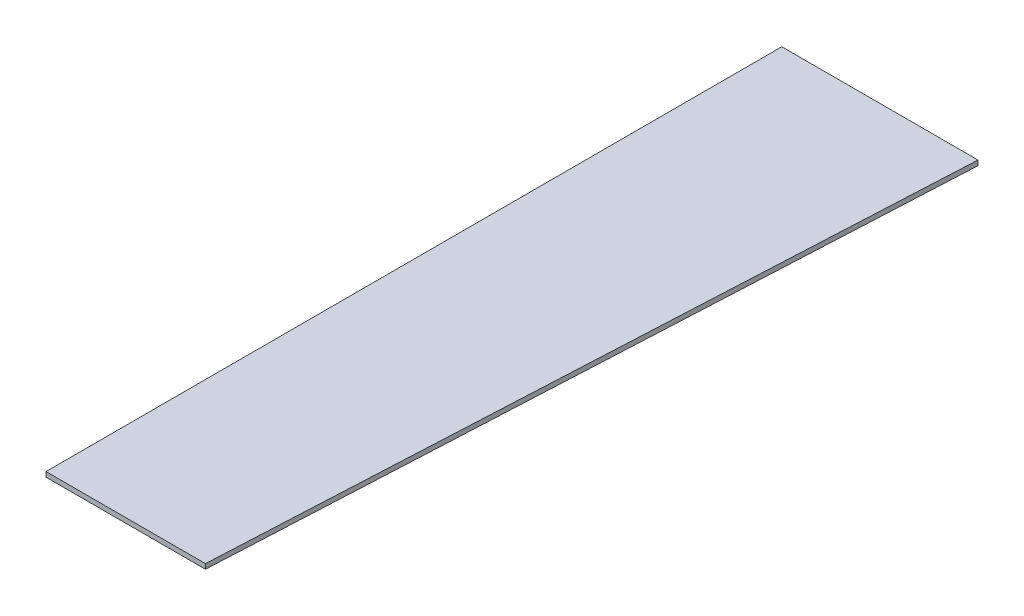
ISO-10303-21;
HEADER;
FILE_DESCRIPTION(('STEP AP214'),'2;1');
FILE_NAME('part.step','',(''),(''),'','','');
FILE_SCHEMA(('AUTOMOTIVE_DESIGN { 1 0 10303 214 1 1 1 1 }'));
ENDSEC;
DATA;
#1=APPLICATION_CONTEXT('core data for automotive mechanical design processes');
#2=APPLICATION_PROTOCOL_DEFINITION('international standard','automotive_design',2000,#1);
#3=PRODUCT_CONTEXT('',#1,'mechanical');
#4=PRODUCT('Part','Part','',(#3));
#5=PRODUCT_RELATED_PRODUCT_CATEGORY('part','',(#4));
#6=PRODUCT_DEFINITION_FORMATION('','',#4);
#7=PRODUCT_DEFINITION_CONTEXT('part definition',#1,'design');
#8=PRODUCT_DEFINITION('design','',#6,#7);
#9=PRODUCT_DEFINITION_SHAPE('','',#8);
#10=(LENGTH_UNIT() NAMED_UNIT(*) SI_UNIT(.MILLI.,.METRE.));
#11=(NAMED_UNIT(*) PLANE_ANGLE_UNIT() SI_UNIT($,.RADIAN.));
#12=(NAMED_UNIT(*) SI_UNIT($,.STERADIAN.) SOLID_ANGLE_UNIT());
#13=UNCERTAINTY_MEASURE_WITH_UNIT(LENGTH_MEASURE(1.E-05),#10,'distance_accuracy_value','');
#14=(GEOMETRIC_REPRESENTATION_CONTEXT(3) GLOBAL_UNCERTAINTY_ASSIGNED_CONTEXT((#13)) GLOBAL_UNIT_ASSIGNED_CONTEXT((#10,
#11,#12)) REPRESENTATION_CONTEXT('',''));
#15=CARTESIAN_POINT('',(0.,0.,0.));
#16=DIRECTION('',(0.,0.,1.));
#17=DIRECTION('',(1.,0.,0.));
#18=AXIS2_PLACEMENT_3D('',#15,#16,#17);
#19=CARTESIAN_POINT('',(0.,10.,0.));
#20=DIRECTION('',(1.,0.,0.));
#21=DIRECTION('',(0.,0.,-1.));
#22=AXIS2_PLACEMENT_3D('',#19,#20,#21);
#23=PLANE('',#22);
#24=DIRECTION('',(0.,0.,1.));
#25=VECTOR('',#24,1.);
#26=CARTESIAN_POINT('',(0.,0.,0.));
#27=LINE('',#26,#25);
#28=CARTESIAN_POINT('',(0.,0.,0.));
#29=VERTEX_POINT('',#28);
#30=CARTESIAN_POINT('',(1.83697019872103E-13,0.,1500.));
#31=VERTEX_POINT('',#30);
#32=EDGE_CURVE('E94',#29,#31,#27,.T.);
#33=ORIENTED_EDGE('',*,*,#32,.T.);
#34=DIRECTION('',(0.,-1.,0.));
#35=VECTOR('',#34,1.);
#36=CARTESIAN_POINT('',(1.83697019872103E-13,10.,1500.));
#37=LINE('',#36,#35);
#38=CARTESIAN_POINT('',(1.83697019872103E-13,10.,1500.));
#39=VERTEX_POINT('',#38);
#40=EDGE_CURVE('E11',#39,#31,#37,.T.);
#41=ORIENTED_EDGE('',*,*,#40,.F.);
#42=DIRECTION('',(0.,0.,1.));
#43=VECTOR('',#42,1.);
#44=CARTESIAN_POINT('',(0.,10.,0.));
#45=LINE('',#44,#43);
#46=CARTESIAN_POINT('',(0.,10.,0.));
#47=VERTEX_POINT('',#46);
#48=EDGE_CURVE('E82',#47,#39,#45,.T.);
#49=ORIENTED_EDGE('',*,*,#48,.F.);
#50=DIRECTION('',(0.,-1.,0.));
#51=VECTOR('',#50,1.);
#52=CARTESIAN_POINT('',(0.,10.,0.));
#53=LINE('',#52,#51);
#54=EDGE_CURVE('E90',#47,#29,#53,.T.);
#55=ORIENTED_EDGE('',*,*,#54,.T.);
#56=EDGE_LOOP('',(#33,#41,#49,#55));
#57=FACE_BOUND('',#56,.T.);
#58=ADVANCED_FACE('F31',(#57),#23,.F.);
#59=CARTESIAN_POINT('',(1.83697019872103E-13,10.,1500.));
#60=DIRECTION('',(0.,0.,-1.));
#61=DIRECTION('',(-1.,0.,0.));
#62=AXIS2_PLACEMENT_3D('',#59,#60,#61);
#63=PLANE('',#62);
#64=DIRECTION('',(1.,0.,0.));
#65=VECTOR('',#64,1.);
#66=CARTESIAN_POINT('',(1.83697019872103E-13,0.,1500.));
#67=LINE('',#66,#65);
#68=CARTESIAN_POINT('',(325.,0.,1500.));
#69=VERTEX_POINT('',#68);
#70=EDGE_CURVE('E86',#31,#69,#67,.T.);
#71=ORIENTED_EDGE('',*,*,#70,.T.);
#72=DIRECTION('',(0.,-1.,0.));
#73=VECTOR('',#72,1.);
#74=CARTESIAN_POINT('',(325.,10.,1500.));
#75=LINE('',#74,#73);
#76=CARTESIAN_POINT('',(325.,10.,1500.));
#77=VERTEX_POINT('',#76);
#78=EDGE_CURVE('E39',#77,#69,#75,.T.);
#79=ORIENTED_EDGE('',*,*,#78,.F.);
#80=DIRECTION('',(1.,0.,0.));
#81=VECTOR('',#80,1.);
#82=CARTESIAN_POINT('',(1.83697019872103E-13,10.,1500.));
#83=LINE('',#82,#81);
#84=EDGE_CURVE('E77',#39,#77,#83,.T.);
#85=ORIENTED_EDGE('',*,*,#84,.F.);
#86=ORIENTED_EDGE('',*,*,#40,.T.);
#87=EDGE_LOOP('',(#71,#79,#85,#86));
#88=FACE_BOUND('',#87,.T.);
#89=ADVANCED_FACE('F85',(#88),#63,.F.);
#90=CARTESIAN_POINT('',(325.,10.,1500.));
#91=DIRECTION('',(-0.998752338877845,0.,-0.0499376169438921));
#92=DIRECTION('',(-0.0499376169438921,0.,0.998752338877845));
#93=AXIS2_PLACEMENT_3D('',#90,#91,#92);
#94=PLANE('',#93);
#95=DIRECTION('',(0.0499376169438921,0.,-0.998752338877845));
#96=VECTOR('',#95,1.);
#97=CARTESIAN_POINT('',(325.,0.,1500.));
#98=LINE('',#97,#96);
#99=CARTESIAN_POINT('',(400.,0.,0.));
#100=VERTEX_POINT('',#99);
#101=EDGE_CURVE('E64',#69,#100,#98,.T.);
#102=ORIENTED_EDGE('',*,*,#101,.T.);
#103=DIRECTION('',(0.,-1.,0.));
#104=VECTOR('',#103,1.);
#105=CARTESIAN_POINT('',(400.,10.,0.));
#106=LINE('',#105,#104);
#107=CARTESIAN_POINT('',(400.,10.,0.));
#108=VERTEX_POINT('',#107);
#109=EDGE_CURVE('E87',#108,#100,#106,.T.);
#110=ORIENTED_EDGE('',*,*,#109,.F.);
#111=DIRECTION('',(0.0499376169438921,0.,-0.998752338877845));
#112=VECTOR('',#111,1.);
#113=CARTESIAN_POINT('',(325.,10.,1500.));
#114=LINE('',#113,#112);
#115=EDGE_CURVE('E80',#77,#108,#114,.T.);
#116=ORIENTED_EDGE('',*,*,#115,.F.);
#117=ORIENTED_EDGE('',*,*,#78,.T.);
#118=EDGE_LOOP('',(#102,#110,#116,#117));
#119=FACE_BOUND('',#118,.T.);
#120=ADVANCED_FACE('F88',(#119),#94,.F.);
#121=CARTESIAN_POINT('',(0.,10.,0.));
#122=DIRECTION('',(0.,0.,1.));
#123=DIRECTION('',(1.,0.,0.));
#124=AXIS2_PLACEMENT_3D('',#121,#122,#123);
#125=PLANE('',#124);
#126=DIRECTION('',(-1.,0.,0.));
#127=VECTOR('',#126,1.);
#128=CARTESIAN_POINT('',(0.,0.,0.));
#129=LINE('',#128,#127);
#130=EDGE_CURVE('E70',#100,#29,#129,.T.);
#131=ORIENTED_EDGE('',*,*,#130,.T.);
#132=ORIENTED_EDGE('',*,*,#54,.F.);
#133=DIRECTION('',(-1.,0.,0.));
#134=VECTOR('',#133,1.);
#135=CARTESIAN_POINT('',(0.,10.,0.));
#136=LINE('',#135,#134);
#137=EDGE_CURVE('E47',#108,#47,#136,.T.);
#138=ORIENTED_EDGE('',*,*,#137,.F.);
#139=ORIENTED_EDGE('',*,*,#109,.T.);
#140=EDGE_LOOP('',(#131,#132,#138,#139));
#141=FACE_BOUND('',#140,.T.);
#142=ADVANCED_FACE('F101',(#141),#125,.F.);
#143=CARTESIAN_POINT('',(1.83697019872103E-13,10.,1500.));
#144=DIRECTION('',(0.,1.,0.));
#145=DIRECTION('',(0.,0.,1.));
#146=AXIS2_PLACEMENT_3D('',#143,#144,#145);
#147=PLANE('',#146);
#148=ORIENTED_EDGE('',*,*,#48,.T.);
#149=ORIENTED_EDGE('',*,*,#84,.T.);
#150=ORIENTED_EDGE('',*,*,#115,.T.);
#151=ORIENTED_EDGE('',*,*,#137,.T.);
#152=EDGE_LOOP('',(#148,#149,#150,#151));
#153=FACE_BOUND('',#152,.T.);
#154=ADVANCED_FACE('F78',(#153),#147,.T.);
#155=CARTESIAN_POINT('',(1.83697019872103E-13,0.,1500.));
#156=DIRECTION('',(0.,1.,0.));
#157=DIRECTION('',(0.,0.,1.));
#158=AXIS2_PLACEMENT_3D('',#155,#156,#157);
#159=PLANE('',#158);
#160=ORIENTED_EDGE('',*,*,#32,.F.);
#161=ORIENTED_EDGE('',*,*,#130,.F.);
#162=ORIENTED_EDGE('',*,*,#101,.F.);
#163=ORIENTED_EDGE('',*,*,#70,.F.);
#164=EDGE_LOOP('',(#160,#161,#162,#163));
#165=FACE_BOUND('',#164,.T.);
#166=ADVANCED_FACE('F104',(#165),#159,.F.);
#167=CLOSED_SHELL('',(#58,#89,#120,#142,#154,#166));
#168=MANIFOLD_SOLID_BREP('B2',#167);
#169=ADVANCED_BREP_SHAPE_REPRESENTATION('',(#18,#168),#14);
#170=SHAPE_DEFINITION_REPRESENTATION(#9,#169);
ENDSEC;
END-ISO-10303-21;
